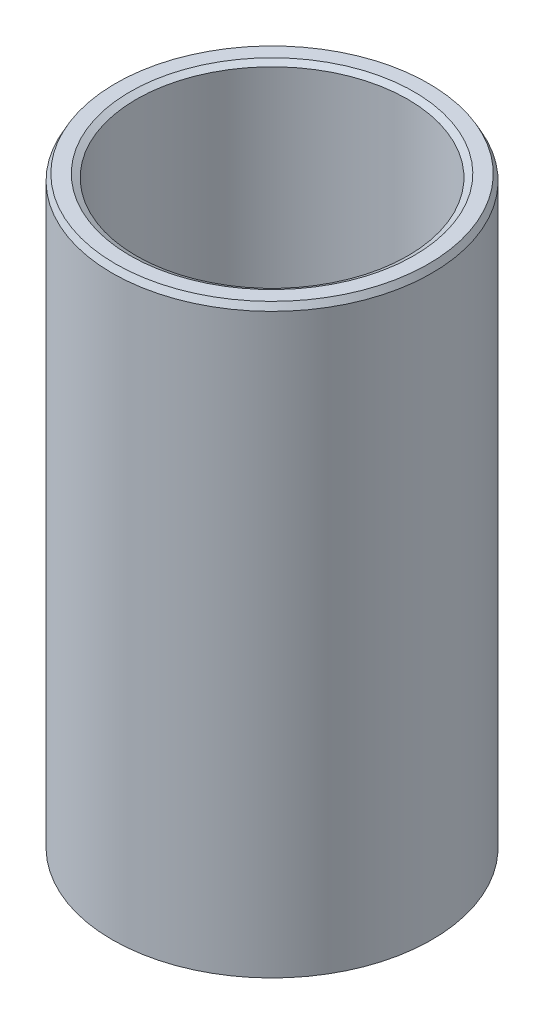
ISO-10303-21;
HEADER;
FILE_DESCRIPTION(('STEP AP214'),'2;1');
FILE_NAME('part.step','',(''),(''),'','','');
FILE_SCHEMA(('AUTOMOTIVE_DESIGN { 1 0 10303 214 1 1 1 1 }'));
ENDSEC;
DATA;
#1=APPLICATION_CONTEXT('core data for automotive mechanical design processes');
#2=APPLICATION_PROTOCOL_DEFINITION('international standard','automotive_design',2000,#1);
#3=PRODUCT_CONTEXT('',#1,'mechanical');
#4=PRODUCT('Part','Part','',(#3));
#5=PRODUCT_RELATED_PRODUCT_CATEGORY('part','',(#4));
#6=PRODUCT_DEFINITION_FORMATION('','',#4);
#7=PRODUCT_DEFINITION_CONTEXT('part definition',#1,'design');
#8=PRODUCT_DEFINITION('design','',#6,#7);
#9=PRODUCT_DEFINITION_SHAPE('','',#8);
#10=(LENGTH_UNIT() NAMED_UNIT(*) SI_UNIT(.MILLI.,.METRE.));
#11=(NAMED_UNIT(*) PLANE_ANGLE_UNIT() SI_UNIT($,.RADIAN.));
#12=(NAMED_UNIT(*) SI_UNIT($,.STERADIAN.) SOLID_ANGLE_UNIT());
#13=UNCERTAINTY_MEASURE_WITH_UNIT(LENGTH_MEASURE(1.E-05),#10,'distance_accuracy_value','');
#14=(GEOMETRIC_REPRESENTATION_CONTEXT(3) GLOBAL_UNCERTAINTY_ASSIGNED_CONTEXT((#13)) GLOBAL_UNIT_ASSIGNED_CONTEXT((#10,
#11,#12)) REPRESENTATION_CONTEXT('',''));
#15=CARTESIAN_POINT('',(0.,0.,0.));
#16=DIRECTION('',(0.,0.,1.));
#17=DIRECTION('',(1.,0.,0.));
#18=AXIS2_PLACEMENT_3D('',#15,#16,#17);
#19=CARTESIAN_POINT('',(0.,183.62326400279,0.));
#20=DIRECTION('',(0.,-1.,0.));
#21=DIRECTION('',(0.,0.,-1.));
#22=AXIS2_PLACEMENT_3D('',#19,#20,#21);
#23=CYLINDRICAL_SURFACE('',#22,50.);
#24=CARTESIAN_POINT('',(0.,1.05983279814892,0.));
#25=DIRECTION('',(0.,1.,0.));
#26=DIRECTION('',(0.,0.,1.));
#27=AXIS2_PLACEMENT_3D('',#24,#25,#26);
#28=CIRCLE('',#27,50.);
#29=CARTESIAN_POINT('',(0.,1.05983279814892,50.));
#30=VERTEX_POINT('',#29);
#31=EDGE_CURVE('E10',#30,#30,#28,.T.);
#32=ORIENTED_EDGE('',*,*,#31,.T.);
#33=EDGE_LOOP('',(#32));
#34=FACE_BOUND('',#33,.T.);
#35=CARTESIAN_POINT('',(0.,181.661013993439,0.));
#36=DIRECTION('',(0.,1.,0.));
#37=DIRECTION('',(0.,0.,1.));
#38=AXIS2_PLACEMENT_3D('',#35,#36,#37);
#39=CIRCLE('',#38,50.);
#40=CARTESIAN_POINT('',(0.,181.661013993439,50.));
#41=VERTEX_POINT('',#40);
#42=EDGE_CURVE('E50',#41,#41,#39,.F.);
#43=ORIENTED_EDGE('',*,*,#42,.T.);
#44=EDGE_LOOP('',(#43));
#45=FACE_BOUND('',#44,.T.);
#46=ADVANCED_FACE('F39',(#34,#45),#23,.T.);
#47=CARTESIAN_POINT('',(0.,183.62326400279,0.));
#48=DIRECTION('',(0.,1.,0.));
#49=DIRECTION('',(0.,0.,1.));
#50=AXIS2_PLACEMENT_3D('',#47,#48,#49);
#51=PLANE('',#50);
#52=CARTESIAN_POINT('',(0.,183.62326400279,0.));
#53=DIRECTION('',(0.,1.,0.));
#54=DIRECTION('',(0.,0.,1.));
#55=AXIS2_PLACEMENT_3D('',#52,#53,#54);
#56=CIRCLE('',#55,44.41337836895);
#57=CARTESIAN_POINT('',(0.,183.62326400279,44.41337836895));
#58=VERTEX_POINT('',#57);
#59=EDGE_CURVE('E58',#58,#58,#56,.F.);
#60=ORIENTED_EDGE('',*,*,#59,.T.);
#61=EDGE_LOOP('',(#60));
#62=FACE_BOUND('',#61,.T.);
#63=CARTESIAN_POINT('',(0.,183.62326400279,0.));
#64=DIRECTION('',(0.,1.,0.));
#65=DIRECTION('',(0.,0.,1.));
#66=AXIS2_PLACEMENT_3D('',#63,#64,#65);
#67=CIRCLE('',#66,48.9401672018511);
#68=CARTESIAN_POINT('',(0.,183.62326400279,48.9401672018511));
#69=VERTEX_POINT('',#68);
#70=EDGE_CURVE('E61',#69,#69,#67,.T.);
#71=ORIENTED_EDGE('',*,*,#70,.T.);
#72=EDGE_LOOP('',(#71));
#73=FACE_BOUND('',#72,.T.);
#74=ADVANCED_FACE('F88',(#62,#73),#51,.T.);
#75=CARTESIAN_POINT('',(0.,0.,0.));
#76=DIRECTION('',(0.,1.,0.));
#77=DIRECTION('',(0.,0.,1.));
#78=AXIS2_PLACEMENT_3D('',#75,#76,#77);
#79=PLANE('',#78);
#80=CARTESIAN_POINT('',(0.,0.,0.));
#81=DIRECTION('',(0.,1.,0.));
#82=DIRECTION('',(0.,0.,1.));
#83=AXIS2_PLACEMENT_3D('',#80,#81,#82);
#84=CIRCLE('',#83,43.5109611577484);
#85=CARTESIAN_POINT('',(0.,0.,43.5109611577484));
#86=VERTEX_POINT('',#85);
#87=EDGE_CURVE('E51',#86,#86,#84,.T.);
#88=ORIENTED_EDGE('',*,*,#87,.T.);
#89=EDGE_LOOP('',(#88));
#90=FACE_BOUND('',#89,.T.);
#91=CARTESIAN_POINT('',(0.,0.,0.));
#92=DIRECTION('',(0.,1.,0.));
#93=DIRECTION('',(0.,0.,1.));
#94=AXIS2_PLACEMENT_3D('',#91,#92,#93);
#95=CIRCLE('',#94,48.0377499906494);
#96=CARTESIAN_POINT('',(0.,0.,48.0377499906494));
#97=VERTEX_POINT('',#96);
#98=EDGE_CURVE('E54',#97,#97,#95,.F.);
#99=ORIENTED_EDGE('',*,*,#98,.T.);
#100=EDGE_LOOP('',(#99));
#101=FACE_BOUND('',#100,.T.);
#102=ADVANCED_FACE('F83',(#90,#101),#79,.F.);
#103=CARTESIAN_POINT('',(0.,183.62326400279,0.));
#104=DIRECTION('',(0.,-1.,0.));
#105=DIRECTION('',(0.,0.,-1.));
#106=AXIS2_PLACEMENT_3D('',#103,#104,#105);
#107=CYLINDRICAL_SURFACE('',#106,42.4511283595995);
#108=CARTESIAN_POINT('',(0.,182.563431204641,0.));
#109=DIRECTION('',(0.,1.,0.));
#110=DIRECTION('',(0.,0.,1.));
#111=AXIS2_PLACEMENT_3D('',#108,#109,#110);
#112=CIRCLE('',#111,42.4511283595995);
#113=CARTESIAN_POINT('',(0.,182.563431204641,42.4511283595995));
#114=VERTEX_POINT('',#113);
#115=EDGE_CURVE('E67',#114,#114,#112,.T.);
#116=ORIENTED_EDGE('',*,*,#115,.T.);
#117=EDGE_LOOP('',(#116));
#118=FACE_BOUND('',#117,.T.);
#119=CARTESIAN_POINT('',(0.,1.9622500093506,0.));
#120=DIRECTION('',(0.,1.,0.));
#121=DIRECTION('',(0.,0.,1.));
#122=AXIS2_PLACEMENT_3D('',#119,#120,#121);
#123=CIRCLE('',#122,42.4511283595995);
#124=CARTESIAN_POINT('',(0.,1.9622500093506,42.4511283595995));
#125=VERTEX_POINT('',#124);
#126=EDGE_CURVE('E69',#125,#125,#123,.F.);
#127=ORIENTED_EDGE('',*,*,#126,.T.);
#128=EDGE_LOOP('',(#127));
#129=FACE_BOUND('',#128,.T.);
#130=ADVANCED_FACE('F71',(#118,#129),#107,.F.);
#131=CARTESIAN_POINT('',(0.,182.563431204641,0.));
#132=DIRECTION('',(0.,1.,0.));
#133=DIRECTION('',(0.,0.,1.));
#134=AXIS2_PLACEMENT_3D('',#131,#132,#133);
#135=CONICAL_SURFACE('',#134,42.4511283595995,1.07557713396476);
#136=ORIENTED_EDGE('',*,*,#59,.F.);
#137=EDGE_LOOP('',(#136));
#138=FACE_BOUND('',#137,.T.);
#139=ORIENTED_EDGE('',*,*,#115,.F.);
#140=EDGE_LOOP('',(#139));
#141=FACE_BOUND('',#140,.T.);
#142=ADVANCED_FACE('F77',(#138,#141),#135,.F.);
#143=CARTESIAN_POINT('',(0.,0.,0.));
#144=DIRECTION('',(0.,-1.,0.));
#145=DIRECTION('',(0.,0.,-1.));
#146=AXIS2_PLACEMENT_3D('',#143,#144,#145);
#147=CONICAL_SURFACE('',#146,43.5109611577484,0.495219192830142);
#148=ORIENTED_EDGE('',*,*,#126,.F.);
#149=EDGE_LOOP('',(#148));
#150=FACE_BOUND('',#149,.T.);
#151=ORIENTED_EDGE('',*,*,#87,.F.);
#152=EDGE_LOOP('',(#151));
#153=FACE_BOUND('',#152,.T.);
#154=ADVANCED_FACE('F73',(#150,#153),#147,.F.);
#155=CARTESIAN_POINT('',(0.,1.05983279814892,0.));
#156=DIRECTION('',(0.,1.,0.));
#157=DIRECTION('',(0.,0.,1.));
#158=AXIS2_PLACEMENT_3D('',#155,#156,#157);
#159=CONICAL_SURFACE('',#158,50.,1.07557713396475);
#160=ORIENTED_EDGE('',*,*,#98,.F.);
#161=EDGE_LOOP('',(#160));
#162=FACE_BOUND('',#161,.T.);
#163=ORIENTED_EDGE('',*,*,#31,.F.);
#164=EDGE_LOOP('',(#163));
#165=FACE_BOUND('',#164,.T.);
#166=ADVANCED_FACE('F76',(#162,#165),#159,.T.);
#167=CARTESIAN_POINT('',(0.,183.62326400279,0.));
#168=DIRECTION('',(0.,-1.,0.));
#169=DIRECTION('',(0.,0.,-1.));
#170=AXIS2_PLACEMENT_3D('',#167,#168,#169);
#171=CONICAL_SURFACE('',#170,48.9401672018511,0.495219192830147);
#172=ORIENTED_EDGE('',*,*,#42,.F.);
#173=EDGE_LOOP('',(#172));
#174=FACE_BOUND('',#173,.T.);
#175=ORIENTED_EDGE('',*,*,#70,.F.);
#176=EDGE_LOOP('',(#175));
#177=FACE_BOUND('',#176,.T.);
#178=ADVANCED_FACE('F45',(#174,#177),#171,.T.);
#179=CLOSED_SHELL('',(#46,#74,#102,#130,#142,#154,#166,#178));
#180=MANIFOLD_SOLID_BREP('B2',#179);
#181=ADVANCED_BREP_SHAPE_REPRESENTATION('',(#18,#180),#14);
#182=SHAPE_DEFINITION_REPRESENTATION(#9,#181);
ENDSEC;
END-ISO-10303-21;
